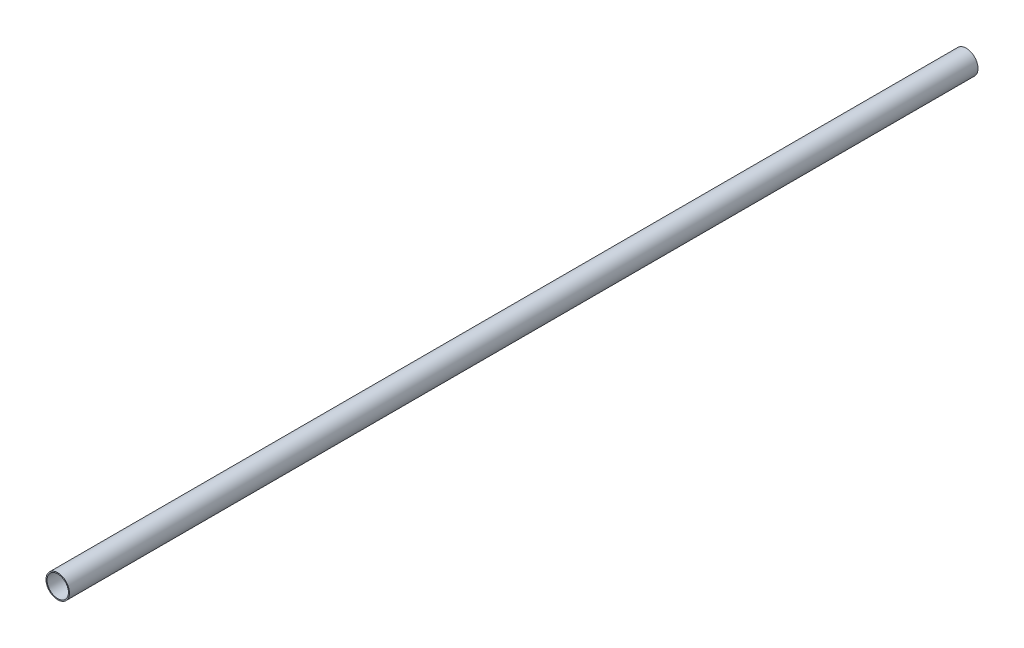
ISO-10303-21;
HEADER;
FILE_DESCRIPTION(('STEP AP214'),'2;1');
FILE_NAME('part.step','',(''),(''),'','','');
FILE_SCHEMA(('AUTOMOTIVE_DESIGN { 1 0 10303 214 1 1 1 1 }'));
ENDSEC;
DATA;
#1=APPLICATION_CONTEXT('core data for automotive mechanical design processes');
#2=APPLICATION_PROTOCOL_DEFINITION('international standard','automotive_design',2000,#1);
#3=PRODUCT_CONTEXT('',#1,'mechanical');
#4=PRODUCT('Part','Part','',(#3));
#5=PRODUCT_RELATED_PRODUCT_CATEGORY('part','',(#4));
#6=PRODUCT_DEFINITION_FORMATION('','',#4);
#7=PRODUCT_DEFINITION_CONTEXT('part definition',#1,'design');
#8=PRODUCT_DEFINITION('design','',#6,#7);
#9=PRODUCT_DEFINITION_SHAPE('','',#8);
#10=(LENGTH_UNIT() NAMED_UNIT(*) SI_UNIT(.MILLI.,.METRE.));
#11=(NAMED_UNIT(*) PLANE_ANGLE_UNIT() SI_UNIT($,.RADIAN.));
#12=(NAMED_UNIT(*) SI_UNIT($,.STERADIAN.) SOLID_ANGLE_UNIT());
#13=UNCERTAINTY_MEASURE_WITH_UNIT(LENGTH_MEASURE(1.E-05),#10,'distance_accuracy_value','');
#14=(GEOMETRIC_REPRESENTATION_CONTEXT(3) GLOBAL_UNCERTAINTY_ASSIGNED_CONTEXT((#13)) GLOBAL_UNIT_ASSIGNED_CONTEXT((#10,
#11,#12)) REPRESENTATION_CONTEXT('',''));
#15=CARTESIAN_POINT('',(0.,0.,0.));
#16=DIRECTION('',(0.,0.,1.));
#17=DIRECTION('',(1.,0.,0.));
#18=AXIS2_PLACEMENT_3D('',#15,#16,#17);
#19=CARTESIAN_POINT('',(0.,0.,850.));
#20=DIRECTION('',(0.,0.,1.));
#21=DIRECTION('',(1.,0.,0.));
#22=AXIS2_PLACEMENT_3D('',#19,#20,#21);
#23=PLANE('',#22);
#24=CARTESIAN_POINT('',(0.,0.,850.));
#25=DIRECTION('',(0.,0.,1.));
#26=DIRECTION('',(1.,0.,0.));
#27=AXIS2_PLACEMENT_3D('',#24,#25,#26);
#28=CIRCLE('',#27,11.);
#29=CARTESIAN_POINT('',(11.,0.,850.));
#30=VERTEX_POINT('',#29);
#31=EDGE_CURVE('E10',#30,#30,#28,.T.);
#32=ORIENTED_EDGE('',*,*,#31,.T.);
#33=EDGE_LOOP('',(#32));
#34=FACE_BOUND('',#33,.T.);
#35=CARTESIAN_POINT('',(0.,0.,850.));
#36=DIRECTION('',(0.,0.,1.));
#37=DIRECTION('',(1.,0.,0.));
#38=AXIS2_PLACEMENT_3D('',#35,#36,#37);
#39=CIRCLE('',#38,10.);
#40=CARTESIAN_POINT('',(10.,0.,850.));
#41=VERTEX_POINT('',#40);
#42=EDGE_CURVE('E48',#41,#41,#39,.T.);
#43=ORIENTED_EDGE('',*,*,#42,.F.);
#44=EDGE_LOOP('',(#43));
#45=FACE_BOUND('',#44,.T.);
#46=ADVANCED_FACE('F37',(#34,#45),#23,.T.);
#47=CARTESIAN_POINT('',(0.,0.,0.));
#48=DIRECTION('',(0.,0.,1.));
#49=DIRECTION('',(1.,0.,0.));
#50=AXIS2_PLACEMENT_3D('',#47,#48,#49);
#51=PLANE('',#50);
#52=CARTESIAN_POINT('',(0.,0.,0.));
#53=DIRECTION('',(0.,0.,1.));
#54=DIRECTION('',(1.,0.,0.));
#55=AXIS2_PLACEMENT_3D('',#52,#53,#54);
#56=CIRCLE('',#55,11.);
#57=CARTESIAN_POINT('',(11.,0.,0.));
#58=VERTEX_POINT('',#57);
#59=EDGE_CURVE('E41',#58,#58,#56,.T.);
#60=ORIENTED_EDGE('',*,*,#59,.F.);
#61=EDGE_LOOP('',(#60));
#62=FACE_BOUND('',#61,.T.);
#63=CARTESIAN_POINT('',(0.,0.,0.));
#64=DIRECTION('',(0.,0.,1.));
#65=DIRECTION('',(1.,0.,0.));
#66=AXIS2_PLACEMENT_3D('',#63,#64,#65);
#67=CIRCLE('',#66,10.);
#68=CARTESIAN_POINT('',(10.,0.,0.));
#69=VERTEX_POINT('',#68);
#70=EDGE_CURVE('E50',#69,#69,#67,.T.);
#71=ORIENTED_EDGE('',*,*,#70,.T.);
#72=EDGE_LOOP('',(#71));
#73=FACE_BOUND('',#72,.T.);
#74=ADVANCED_FACE('F60',(#62,#73),#51,.F.);
#75=CARTESIAN_POINT('',(0.,0.,850.));
#76=DIRECTION('',(0.,0.,-1.));
#77=DIRECTION('',(-1.,0.,0.));
#78=AXIS2_PLACEMENT_3D('',#75,#76,#77);
#79=CYLINDRICAL_SURFACE('',#78,11.);
#80=ORIENTED_EDGE('',*,*,#31,.F.);
#81=EDGE_LOOP('',(#80));
#82=FACE_BOUND('',#81,.T.);
#83=ORIENTED_EDGE('',*,*,#59,.T.);
#84=EDGE_LOOP('',(#83));
#85=FACE_BOUND('',#84,.T.);
#86=ADVANCED_FACE('F39',(#82,#85),#79,.T.);
#87=CARTESIAN_POINT('',(0.,0.,850.));
#88=DIRECTION('',(0.,0.,-1.));
#89=DIRECTION('',(-1.,0.,0.));
#90=AXIS2_PLACEMENT_3D('',#87,#88,#89);
#91=CYLINDRICAL_SURFACE('',#90,10.);
#92=ORIENTED_EDGE('',*,*,#42,.T.);
#93=EDGE_LOOP('',(#92));
#94=FACE_BOUND('',#93,.T.);
#95=ORIENTED_EDGE('',*,*,#70,.F.);
#96=EDGE_LOOP('',(#95));
#97=FACE_BOUND('',#96,.T.);
#98=ADVANCED_FACE('F56',(#94,#97),#91,.F.);
#99=CLOSED_SHELL('',(#46,#74,#86,#98));
#100=MANIFOLD_SOLID_BREP('B2',#99);
#101=ADVANCED_BREP_SHAPE_REPRESENTATION('',(#18,#100),#14);
#102=SHAPE_DEFINITION_REPRESENTATION(#9,#101);
ENDSEC;
END-ISO-10303-21;
